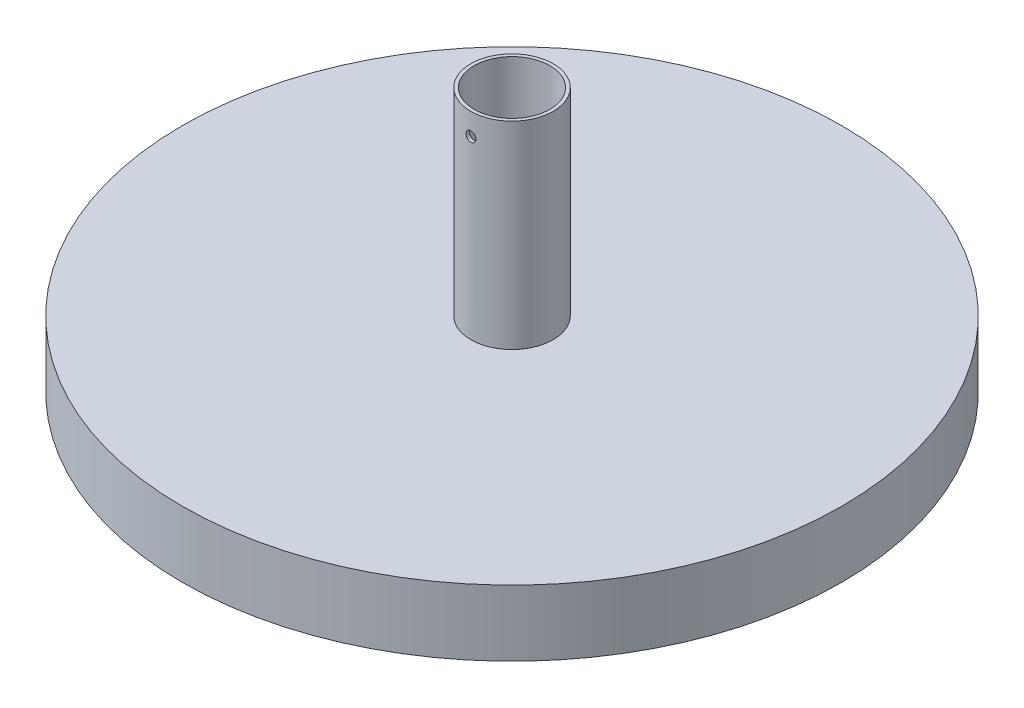
ISO-10303-21;
HEADER;
FILE_DESCRIPTION(('STEP AP214'),'2;1');
FILE_NAME('part.step','',(''),(''),'','','');
FILE_SCHEMA(('AUTOMOTIVE_DESIGN { 1 0 10303 214 1 1 1 1 }'));
ENDSEC;
DATA;
#1=APPLICATION_CONTEXT('core data for automotive mechanical design processes');
#2=APPLICATION_PROTOCOL_DEFINITION('international standard','automotive_design',2000,#1);
#3=PRODUCT_CONTEXT('',#1,'mechanical');
#4=PRODUCT('Part','Part','',(#3));
#5=PRODUCT_RELATED_PRODUCT_CATEGORY('part','',(#4));
#6=PRODUCT_DEFINITION_FORMATION('','',#4);
#7=PRODUCT_DEFINITION_CONTEXT('part definition',#1,'design');
#8=PRODUCT_DEFINITION('design','',#6,#7);
#9=PRODUCT_DEFINITION_SHAPE('','',#8);
#10=(LENGTH_UNIT() NAMED_UNIT(*) SI_UNIT(.MILLI.,.METRE.));
#11=(NAMED_UNIT(*) PLANE_ANGLE_UNIT() SI_UNIT($,.RADIAN.));
#12=(NAMED_UNIT(*) SI_UNIT($,.STERADIAN.) SOLID_ANGLE_UNIT());
#13=UNCERTAINTY_MEASURE_WITH_UNIT(LENGTH_MEASURE(1.E-05),#10,'distance_accuracy_value','');
#14=(GEOMETRIC_REPRESENTATION_CONTEXT(3) GLOBAL_UNCERTAINTY_ASSIGNED_CONTEXT((#13)) GLOBAL_UNIT_ASSIGNED_CONTEXT((#10,
#11,#12)) REPRESENTATION_CONTEXT('',''));
#15=CARTESIAN_POINT('',(0.,0.,0.));
#16=DIRECTION('',(0.,0.,1.));
#17=DIRECTION('',(1.,0.,0.));
#18=AXIS2_PLACEMENT_3D('',#15,#16,#17);
#19=CARTESIAN_POINT('',(0.,80.,0.));
#20=DIRECTION('',(0.,-1.,0.));
#21=DIRECTION('',(0.,0.,-1.));
#22=AXIS2_PLACEMENT_3D('',#19,#20,#21);
#23=CYLINDRICAL_SURFACE('',#22,12.5);
#24=CARTESIAN_POINT('',(0.,80.,0.));
#25=DIRECTION('',(0.,1.,0.));
#26=DIRECTION('',(0.,0.,1.));
#27=AXIS2_PLACEMENT_3D('',#24,#25,#26);
#28=CIRCLE('',#27,12.5);
#29=CARTESIAN_POINT('',(0.,80.,12.5));
#30=VERTEX_POINT('',#29);
#31=EDGE_CURVE('E55',#30,#30,#28,.T.);
#32=ORIENTED_EDGE('',*,*,#31,.F.);
#33=EDGE_LOOP('',(#32));
#34=FACE_BOUND('',#33,.T.);
#35=CARTESIAN_POINT('',(0.,20.,0.));
#36=DIRECTION('',(0.,1.,0.));
#37=DIRECTION('',(0.,0.,1.));
#38=AXIS2_PLACEMENT_3D('',#35,#36,#37);
#39=CIRCLE('',#38,12.5);
#40=CARTESIAN_POINT('',(0.,20.,12.5));
#41=VERTEX_POINT('',#40);
#42=EDGE_CURVE('E57',#41,#41,#39,.T.);
#43=ORIENTED_EDGE('',*,*,#42,.T.);
#44=EDGE_LOOP('',(#43));
#45=FACE_BOUND('',#44,.T.);
#46=CARTESIAN_POINT('',(-1.5,73.3831743689609,12.4096736459908));
#47=CARTESIAN_POINT('',(-1.49999641586388,73.4671039395561,12.4096748089167));
#48=CARTESIAN_POINT('',(-1.49293206748169,73.5510866290216,12.4105342894214));
#49=CARTESIAN_POINT('',(-1.46486159354819,73.7167166749767,12.4138782255217));
#50=CARTESIAN_POINT('',(-1.44384072619509,73.7983614668014,12.4163643992983));
#51=CARTESIAN_POINT('',(-1.38848417307918,73.9568935717178,12.4226761552619));
#52=CARTESIAN_POINT('',(-1.35415731394875,74.033783999529,12.426500849368));
#53=CARTESIAN_POINT('',(-1.27318168778972,74.1806979400113,12.4350576249844));
#54=CARTESIAN_POINT('',(-1.22653510106008,74.2507226647448,12.4397895458966));
#55=CARTESIAN_POINT('',(-1.1219857196502,74.382294254766,12.4496550027324));
#56=CARTESIAN_POINT('',(-1.06403198625324,74.4438005161352,12.4547902908254));
#57=CARTESIAN_POINT('',(-0.938622932174408,74.5562387280418,12.4648680792729));
#58=CARTESIAN_POINT('',(-0.87116714752708,74.6071701619318,12.4698105701984));
#59=CARTESIAN_POINT('',(-0.728414784233999,74.697157635429,12.4789637011531));
#60=CARTESIAN_POINT('',(-0.653094976924504,74.7361770768307,12.4831720690333));
#61=CARTESIAN_POINT('',(-0.496912883636399,74.8009985991532,12.4903635621621));
#62=CARTESIAN_POINT('',(-0.416050788042783,74.8268011338347,12.4933467294733));
#63=CARTESIAN_POINT('',(-0.251493928492555,74.8643354970126,12.4977393662263));
#64=CARTESIAN_POINT('',(-0.167814735521703,74.8761346956838,12.4991563682204));
#65=CARTESIAN_POINT('',(0.000347248334270155,74.8855361686161,12.5002827183051));
#66=CARTESIAN_POINT('',(0.0848300098341581,74.88313896004,12.4999921286017));
#67=CARTESIAN_POINT('',(0.251742833758755,74.8642698080352,12.4977421462633));
#68=CARTESIAN_POINT('',(0.334181218784098,74.8478703164747,12.4957913442169));
#69=CARTESIAN_POINT('',(0.49512718504558,74.8015752931029,12.490449821119));
#70=CARTESIAN_POINT('',(0.573634696521293,74.7716795218701,12.4870590745233));
#71=CARTESIAN_POINT('',(0.72471556162968,74.6991630045076,12.4792038952277));
#72=CARTESIAN_POINT('',(0.797273648637686,74.6565107509577,12.4747368094346));
#73=CARTESIAN_POINT('',(0.934229460099386,74.5597149194828,12.465229048358));
#74=CARTESIAN_POINT('',(0.998626839383438,74.5055708557531,12.4601883488298));
#75=CARTESIAN_POINT('',(1.11785860561524,74.3869221941906,12.4500603372648));
#76=CARTESIAN_POINT('',(1.17263019439189,74.3223544782741,12.4449729316271));
#77=CARTESIAN_POINT('',(1.27056795912578,74.1849086121211,12.4353563023037));
#78=CARTESIAN_POINT('',(1.31373410365262,74.1120304393786,12.4308270801297));
#79=CARTESIAN_POINT('',(1.38723839179324,73.9599781238872,12.4228396027608));
#80=CARTESIAN_POINT('',(1.4175717557882,73.8808016483319,12.4193817467283));
#81=CARTESIAN_POINT('',(1.46449505016188,73.7184281892103,12.4139364153306));
#82=CARTESIAN_POINT('',(1.48108558929275,73.6352313839012,12.4119488748366));
#83=CARTESIAN_POINT('',(1.49996964356083,73.4677328207725,12.4096810007818));
#84=CARTESIAN_POINT('',(1.50235142135386,73.3834411510203,12.4093901280317));
#85=CARTESIAN_POINT('',(1.49298299027802,73.2156599785394,12.4105206650573));
#86=CARTESIAN_POINT('',(1.48123305845624,73.1321704601172,12.411942041265));
#87=CARTESIAN_POINT('',(1.44400895971009,72.9686264771619,12.4163273137489));
#88=CARTESIAN_POINT('',(1.41857731249469,72.8885621955562,12.4192864301079));
#89=CARTESIAN_POINT('',(1.35475538396312,72.7338347274729,12.4264098926624));
#90=CARTESIAN_POINT('',(1.31636468129306,72.6591717167094,12.4305742780457));
#91=CARTESIAN_POINT('',(1.22749651360806,72.5169662214736,12.439664365665));
#92=CARTESIAN_POINT('',(1.17696103570738,72.4494602255202,12.4445936804928));
#93=CARTESIAN_POINT('',(1.06532008918354,72.323856812455,12.4546467770184));
#94=CARTESIAN_POINT('',(1.00421424221811,72.2657597322579,12.4597705656719));
#95=CARTESIAN_POINT('',(0.872782136333877,72.1603144953434,12.4696675472455));
#96=CARTESIAN_POINT('',(0.802409249708932,72.1130242457052,12.4744387628015));
#97=CARTESIAN_POINT('',(0.654668214705303,72.0309352642963,12.483063621558));
#98=CARTESIAN_POINT('',(0.577300197822221,71.9961362977737,12.4869172820019));
#99=CARTESIAN_POINT('',(0.417959622360004,71.940113866523,12.4932640215257));
#100=CARTESIAN_POINT('',(0.335999085323601,71.9188566090188,12.4957604851314));
#101=CARTESIAN_POINT('',(0.169640292495747,71.8904109971698,12.4991255682254));
#102=CARTESIAN_POINT('',(0.0852421377306375,71.8832220606143,12.4999942550783));
#103=CARTESIAN_POINT('',(-0.0830300031278225,71.8831274469047,12.5000056524324));
#104=CARTESIAN_POINT('',(-0.166903952329428,71.8901323506193,12.4991591682624));
#105=CARTESIAN_POINT('',(-0.332273612398109,71.9180375964121,12.4958567701035));
#106=CARTESIAN_POINT('',(-0.413769324044735,71.9389379339356,12.4934008566421));
#107=CARTESIAN_POINT('',(-0.5720597779918,71.9940133765267,12.4871544009745));
#108=CARTESIAN_POINT('',(-0.648855904373991,72.0281845511881,12.4833642539575));
#109=CARTESIAN_POINT('',(-0.795637705262649,72.1088224037531,12.474869622158));
#110=CARTESIAN_POINT('',(-0.865623324646845,72.1552891811623,12.4701651299761));
#111=CARTESIAN_POINT('',(-0.997254742124286,72.259531209964,12.4603319681132));
#112=CARTESIAN_POINT('',(-1.05884763393839,72.3173730466238,12.4552009088046));
#113=CARTESIAN_POINT('',(-1.17148865356204,72.4425858875371,12.4451123432295));
#114=CARTESIAN_POINT('',(-1.22253427406543,72.5099591512115,12.4401548784622));
#115=CARTESIAN_POINT('',(-1.31278537364372,72.6525958370461,12.4309559603764));
#116=CARTESIAN_POINT('',(-1.35194799100154,72.7278865330973,12.4267171228205));
#117=CARTESIAN_POINT('',(-1.41701902911871,72.8839832458362,12.419466118837));
#118=CARTESIAN_POINT('',(-1.44294198213014,72.9647831045597,12.4164526081981));
#119=CARTESIAN_POINT('',(-1.4745350503682,73.1022041385136,12.4127313618494));
#120=CARTESIAN_POINT('',(-1.48407082470974,73.1579557449408,12.4115903654975));
#121=CARTESIAN_POINT('',(-1.49680448454756,73.270188335028,12.4100611186528));
#122=CARTESIAN_POINT('',(-1.50000241299709,73.3266693137422,12.4096728630583));
#123=CARTESIAN_POINT('',(-1.5,73.3831743689609,12.4096736459908));
#124=B_SPLINE_CURVE_WITH_KNOTS('',3,(#46,#47,#48,#49,#50,#51,#52,#53,#54,#55,#56,#57,#58,#59,
#60,#61,#62,#63,#64,#65,#66,#67,#68,#69,#70,#71,#72,#73,#74,#75,#76,#77,#78,#79,#80,#81,#82,#83,
#84,#85,#86,#87,#88,#89,#90,#91,#92,#93,#94,#95,#96,#97,#98,#99,#100,#101,#102,#103,#104,#105,
#106,#107,#108,#109,#110,#111,#112,#113,#114,#115,#116,#117,#118,#119,#120,#121,#122,#123),
.UNSPECIFIED.,.T.,.F.,(4,2,2,2,2,2,2,2,2,2,2,2,2,2,2,2,2,2,2,2,2,2,2,2,2,2,2,2,2,2,2,2,2,2,2,2,
2,2,4),(0.,0.2515823066096,0.503430774819304,0.755112462522241,1.00674963836109,
1.25954776660375,1.51235824273609,1.76593780876768,2.01950866836446,2.27185458608051,
2.52419131111311,2.77523023079343,3.02627360403334,3.27794222677635,3.52962149067917,
3.78288622204421,4.03615163930558,4.28951130338292,4.5428597440408,4.79463277043146,
5.04640086098249,5.29739099483104,5.54838929022027,5.80061125155307,6.05284224246466,
6.30639464647637,6.55994228515917,6.81285470170486,7.06575665136927,7.31707030939075,
7.56838388503436,7.81962308616497,8.07086432058376,8.32362252061904,8.5764407375911,
8.83016031080821,9.08360079205961,9.25297814464871,9.42235434931909),.UNSPECIFIED.);
#125=CARTESIAN_POINT('',(-1.5,73.3831743689609,12.4096736459908));
#126=VERTEX_POINT('',#125);
#127=EDGE_CURVE('E65',#126,#126,#124,.T.);
#128=ORIENTED_EDGE('',*,*,#127,.T.);
#129=EDGE_LOOP('',(#128));
#130=FACE_BOUND('',#129,.T.);
#131=ADVANCED_FACE('F34',(#34,#45,#130),#23,.T.);
#132=CARTESIAN_POINT('',(0.,80.,0.));
#133=DIRECTION('',(0.,-1.,0.));
#134=DIRECTION('',(0.,0.,-1.));
#135=AXIS2_PLACEMENT_3D('',#132,#133,#134);
#136=CYLINDRICAL_SURFACE('',#135,11.5);
#137=CARTESIAN_POINT('',(0.,20.,0.));
#138=DIRECTION('',(0.,1.,0.));
#139=DIRECTION('',(0.,0.,1.));
#140=AXIS2_PLACEMENT_3D('',#137,#138,#139);
#141=CIRCLE('',#140,11.5);
#142=CARTESIAN_POINT('',(0.,20.,11.5));
#143=VERTEX_POINT('',#142);
#144=EDGE_CURVE('E10',#143,#143,#141,.F.);
#145=ORIENTED_EDGE('',*,*,#144,.T.);
#146=EDGE_LOOP('',(#145));
#147=FACE_BOUND('',#146,.T.);
#148=CARTESIAN_POINT('',(0.,80.,0.));
#149=DIRECTION('',(0.,1.,0.));
#150=DIRECTION('',(0.,0.,1.));
#151=AXIS2_PLACEMENT_3D('',#148,#149,#150);
#152=CIRCLE('',#151,11.5);
#153=CARTESIAN_POINT('',(0.,80.,11.5));
#154=VERTEX_POINT('',#153);
#155=EDGE_CURVE('E60',#154,#154,#152,.T.);
#156=ORIENTED_EDGE('',*,*,#155,.T.);
#157=EDGE_LOOP('',(#156));
#158=FACE_BOUND('',#157,.T.);
#159=CARTESIAN_POINT('',(-1.5,73.3831743689609,11.4017542509914));
#160=CARTESIAN_POINT('',(-1.4999964530145,73.2993041150144,11.4017555010926));
#161=CARTESIAN_POINT('',(-1.49294203416221,73.2153821942801,11.4026896606142));
#162=CARTESIAN_POINT('',(-1.46491333453698,73.049876092776,11.4063237260242));
#163=CARTESIAN_POINT('',(-1.44392470388228,72.9682944125057,11.4090254521656));
#164=CARTESIAN_POINT('',(-1.3886587589991,72.8098888875869,11.4158835494573));
#165=CARTESIAN_POINT('',(-1.3543907018073,72.7330617717207,11.4200389070908));
#166=CARTESIAN_POINT('',(-1.27355889313979,72.5862621128927,11.4293348464697));
#167=CARTESIAN_POINT('',(-1.22699716043964,72.5162884470926,11.4344752664174));
#168=CARTESIAN_POINT('',(-1.12259656958886,72.3847427559446,11.445197137233));
#169=CARTESIAN_POINT('',(-1.06469780379541,72.3232184535593,11.450780832969));
#170=CARTESIAN_POINT('',(-0.939395748791597,72.2107304472991,11.4617399588797));
#171=CARTESIAN_POINT('',(-0.871991977267106,72.1597672796539,11.4671153784682));
#172=CARTESIAN_POINT('',(-0.729292001348489,72.0696759204419,11.4770753814867));
#173=CARTESIAN_POINT('',(-0.653968201092629,72.0305910886122,11.4816570418954));
#174=CARTESIAN_POINT('',(-0.497756037054314,71.9656437023167,11.4894885821545));
#175=CARTESIAN_POINT('',(-0.416867897538947,71.9397806153109,11.4927385156426));
#176=CARTESIAN_POINT('',(-0.25231209376423,71.90215392965,11.4975246059022));
#177=CARTESIAN_POINT('',(-0.168662889559628,71.8903108463172,11.4990704204953));
#178=CARTESIAN_POINT('',(-0.000551051593627484,71.8808139196504,11.5003071067839));
#179=CARTESIAN_POINT('',(0.0839115473355959,71.8831594713873,11.4999980575609));
#180=CARTESIAN_POINT('',(0.250711499958829,71.9019097307406,11.4975676318304));
#181=CARTESIAN_POINT('',(0.333058646852879,71.918228949083,11.495457275758));
#182=CARTESIAN_POINT('',(0.493835455554842,71.9643295496878,11.4896737037343));
#183=CARTESIAN_POINT('',(0.572265037316039,71.9941112069001,11.4860004558634));
#184=CARTESIAN_POINT('',(0.723243851165387,72.0663815147349,11.4774848372199));
#185=CARTESIAN_POINT('',(0.795775273641199,72.1089069570563,11.4726390893116));
#186=CARTESIAN_POINT('',(0.932704606534633,72.2054309114152,11.4623201935655));
#187=CARTESIAN_POINT('',(0.997102110698515,72.25942999615,11.4568470144162));
#188=CARTESIAN_POINT('',(1.11643819513604,72.3778467003042,11.4458372756446));
#189=CARTESIAN_POINT('',(1.17130282662102,72.4423388535874,11.4403005474487));
#190=CARTESIAN_POINT('',(1.2694404810369,72.5796555321102,11.4298278324284));
#191=CARTESIAN_POINT('',(1.31271346156177,72.6524800878311,11.4248918478017));
#192=CARTESIAN_POINT('',(1.38644483776161,72.8044624959882,11.4161795912173));
#193=CARTESIAN_POINT('',(1.41689697165318,72.8836234207373,11.4124038861902));
#194=CARTESIAN_POINT('',(1.46405488015557,73.0459957147137,11.4064505206358));
#195=CARTESIAN_POINT('',(1.48076137834162,73.1292068704912,11.4042727759921));
#196=CARTESIAN_POINT('',(1.49985514370483,73.2966634827124,11.4017774109739));
#197=CARTESIAN_POINT('',(1.50234663257981,73.3808968613547,11.4014462521966));
#198=CARTESIAN_POINT('',(1.49321496203163,73.5485798413725,11.4026457215703));
#199=CARTESIAN_POINT('',(1.48159213091645,73.6320294609334,11.4041763064158));
#200=CARTESIAN_POINT('',(1.44464963434862,73.7954616390173,11.4089144348313));
#201=CARTESIAN_POINT('',(1.41938072914779,73.8754558672874,11.4121157621508));
#202=CARTESIAN_POINT('',(1.35591573806609,74.0300721888816,11.4198296111094));
#203=CARTESIAN_POINT('',(1.31771916001083,74.104694077542,11.4243421826685));
#204=CARTESIAN_POINT('',(1.22922802110627,74.2469181358579,11.4342023912125));
#205=CARTESIAN_POINT('',(1.17886529183312,74.3144775641928,11.4395546717525));
#206=CARTESIAN_POINT('',(1.06756750174709,74.4402221749295,11.4504767766229));
#207=CARTESIAN_POINT('',(1.00663199235395,74.4984069593834,11.4560466101759));
#208=CARTESIAN_POINT('',(0.875462338341604,74.6041183978418,11.4668179794224));
#209=CARTESIAN_POINT('',(0.805172669271255,74.6515764479738,11.4720170065382));
#210=CARTESIAN_POINT('',(0.657558967858992,74.7340119043704,11.4814231748458));
#211=CARTESIAN_POINT('',(0.580235088015162,74.7689895811224,11.4856303375335));
#212=CARTESIAN_POINT('',(0.420973071168357,74.8253588534411,11.4925676402684));
#213=CARTESIAN_POINT('',(0.339049006517437,74.846789662088,11.4953020399787));
#214=CARTESIAN_POINT('',(0.172727196515991,74.8755842986769,11.4990034533124));
#215=CARTESIAN_POINT('',(0.0883295733447125,74.8829488202259,11.4999705540811));
#216=CARTESIAN_POINT('',(-0.0798746769516697,74.883388067676,11.5000279000696));
#217=CARTESIAN_POINT('',(-0.163681043071275,74.8765684091103,11.4991320170928));
#218=CARTESIAN_POINT('',(-0.328945491538632,74.8490571150211,11.4955917059201));
#219=CARTESIAN_POINT('',(-0.410403576567152,74.8283654953342,11.4929472797203));
#220=CARTESIAN_POINT('',(-0.568642219855311,74.7737317027471,11.4862056490748));
#221=CARTESIAN_POINT('',(-0.645424712431703,74.7397950530333,11.4821090502512));
#222=CARTESIAN_POINT('',(-0.79222178732859,74.6596455066347,11.4729159452671));
#223=CARTESIAN_POINT('',(-0.862236260369656,74.6134324117742,11.4678194229654));
#224=CARTESIAN_POINT('',(-0.994048728546025,74.5096527127709,11.4571496362498));
#225=CARTESIAN_POINT('',(-1.05578467493494,74.4520076166137,11.4515732358814));
#226=CARTESIAN_POINT('',(-1.16874758745895,74.3271640677122,11.4405969587125));
#227=CARTESIAN_POINT('',(-1.21997206693609,74.259963360784,11.4351971239349));
#228=CARTESIAN_POINT('',(-1.31064441090517,74.1175900154776,11.425161148306));
#229=CARTESIAN_POINT('',(-1.3500418637493,74.0423850523344,11.4205283132887));
#230=CARTESIAN_POINT('',(-1.41559127347486,73.8864065336068,11.4125895944072));
#231=CARTESIAN_POINT('',(-1.44175750369104,73.8056390859843,11.4092822814234));
#232=CARTESIAN_POINT('',(-1.47390259785781,73.6675825703195,11.4051643222105));
#233=CARTESIAN_POINT('',(-1.48367487173576,73.6111609553857,11.4038919959272));
#234=CARTESIAN_POINT('',(-1.49672475464482,73.4975590241319,11.4021865375875));
#235=CARTESIAN_POINT('',(-1.50000241924847,73.4403787143081,11.4017533983503));
#236=CARTESIAN_POINT('',(-1.5,73.3831743689609,11.4017542509914));
#237=B_SPLINE_CURVE_WITH_KNOTS('',3,(#159,#160,#161,#162,#163,#164,#165,#166,#167,#168,#169,
#170,#171,#172,#173,#174,#175,#176,#177,#178,#179,#180,#181,#182,#183,#184,#185,#186,#187,#188,
#189,#190,#191,#192,#193,#194,#195,#196,#197,#198,#199,#200,#201,#202,#203,#204,#205,#206,#207,
#208,#209,#210,#211,#212,#213,#214,#215,#216,#217,#218,#219,#220,#221,#222,#223,#224,#225,#226,
#227,#228,#229,#230,#231,#232,#233,#234,#235,#236),.UNSPECIFIED.,.T.,.F.,(4,2,2,2,2,2,2,2,2,2,2,
2,2,2,2,2,2,2,2,2,2,2,2,2,2,2,2,2,2,2,2,2,2,2,2,2,2,2,4),(0.,0.251401763409767,
0.503062830563605,0.754548780434035,1.00599345881712,1.25880454908431,1.51162847240694,
1.76536449581032,2.01909029853276,2.27137063822619,2.52364022208435,2.77437738752205,
3.0251196741212,3.27659295200133,3.5280787849124,3.7814359080699,4.03479395807763,
4.28827560662901,4.54174391096105,4.79335142269096,5.04495308198345,5.29562522352573,
5.54630690957675,5.79842717499934,6.05055813995757,6.30425867142355,6.55795370410216,
6.8109109813241,7.0638557849315,7.31492390374274,7.56599173592654,7.81695498432957,
8.06792228421935,8.32067641903949,8.57349027819167,8.82736691371985,9.08096908946925,
9.25244104378407,9.42391153085534),.UNSPECIFIED.);
#238=CARTESIAN_POINT('',(-1.5,73.3831743689609,11.4017542509914));
#239=VERTEX_POINT('',#238);
#240=EDGE_CURVE('E38',#239,#239,#237,.T.);
#241=ORIENTED_EDGE('',*,*,#240,.T.);
#242=EDGE_LOOP('',(#241));
#243=FACE_BOUND('',#242,.T.);
#244=ADVANCED_FACE('F74',(#147,#158,#243),#136,.F.);
#245=CARTESIAN_POINT('',(0.,20.,0.));
#246=DIRECTION('',(0.,-1.,0.));
#247=DIRECTION('',(0.,0.,-1.));
#248=AXIS2_PLACEMENT_3D('',#245,#246,#247);
#249=CYLINDRICAL_SURFACE('',#248,100.);
#250=CARTESIAN_POINT('',(0.,20.,0.));
#251=DIRECTION('',(0.,1.,0.));
#252=DIRECTION('',(0.,0.,1.));
#253=AXIS2_PLACEMENT_3D('',#250,#251,#252);
#254=CIRCLE('',#253,100.);
#255=CARTESIAN_POINT('',(0.,20.,100.));
#256=VERTEX_POINT('',#255);
#257=EDGE_CURVE('E47',#256,#256,#254,.T.);
#258=ORIENTED_EDGE('',*,*,#257,.F.);
#259=EDGE_LOOP('',(#258));
#260=FACE_BOUND('',#259,.T.);
#261=CARTESIAN_POINT('',(0.,0.,0.));
#262=DIRECTION('',(0.,1.,0.));
#263=DIRECTION('',(0.,0.,1.));
#264=AXIS2_PLACEMENT_3D('',#261,#262,#263);
#265=CIRCLE('',#264,100.);
#266=CARTESIAN_POINT('',(0.,0.,100.));
#267=VERTEX_POINT('',#266);
#268=EDGE_CURVE('E51',#267,#267,#265,.T.);
#269=ORIENTED_EDGE('',*,*,#268,.T.);
#270=EDGE_LOOP('',(#269));
#271=FACE_BOUND('',#270,.T.);
#272=ADVANCED_FACE('F36',(#260,#271),#249,.T.);
#273=CARTESIAN_POINT('',(0.,20.,0.));
#274=DIRECTION('',(0.,1.,0.));
#275=DIRECTION('',(0.,0.,1.));
#276=AXIS2_PLACEMENT_3D('',#273,#274,#275);
#277=PLANE('',#276);
#278=ORIENTED_EDGE('',*,*,#42,.F.);
#279=EDGE_LOOP('',(#278));
#280=FACE_BOUND('',#279,.T.);
#281=ORIENTED_EDGE('',*,*,#257,.T.);
#282=EDGE_LOOP('',(#281));
#283=FACE_BOUND('',#282,.T.);
#284=ADVANCED_FACE('F87',(#280,#283),#277,.T.);
#285=CARTESIAN_POINT('',(0.,0.,0.));
#286=DIRECTION('',(0.,1.,0.));
#287=DIRECTION('',(0.,0.,1.));
#288=AXIS2_PLACEMENT_3D('',#285,#286,#287);
#289=PLANE('',#288);
#290=ORIENTED_EDGE('',*,*,#268,.F.);
#291=EDGE_LOOP('',(#290));
#292=FACE_BOUND('',#291,.T.);
#293=ADVANCED_FACE('F82',(#292),#289,.F.);
#294=CARTESIAN_POINT('',(0.,80.,0.));
#295=DIRECTION('',(0.,1.,0.));
#296=DIRECTION('',(0.,0.,1.));
#297=AXIS2_PLACEMENT_3D('',#294,#295,#296);
#298=PLANE('',#297);
#299=ORIENTED_EDGE('',*,*,#31,.T.);
#300=EDGE_LOOP('',(#299));
#301=FACE_BOUND('',#300,.T.);
#302=ORIENTED_EDGE('',*,*,#155,.F.);
#303=EDGE_LOOP('',(#302));
#304=FACE_BOUND('',#303,.T.);
#305=ADVANCED_FACE('F78',(#301,#304),#298,.T.);
#306=ORIENTED_EDGE('',*,*,#144,.F.);
#307=EDGE_LOOP('',(#306));
#308=FACE_BOUND('',#307,.T.);
#309=ADVANCED_FACE('F81',(#308),#277,.T.);
#310=CARTESIAN_POINT('',(0.,73.3831743689609,100.001));
#311=DIRECTION('',(0.,0.,-1.));
#312=DIRECTION('',(-1.,0.,0.));
#313=AXIS2_PLACEMENT_3D('',#310,#311,#312);
#314=CYLINDRICAL_SURFACE('',#313,1.5);
#315=ORIENTED_EDGE('',*,*,#240,.F.);
#316=EDGE_LOOP('',(#315));
#317=FACE_BOUND('',#316,.T.);
#318=ORIENTED_EDGE('',*,*,#127,.F.);
#319=EDGE_LOOP('',(#318));
#320=FACE_BOUND('',#319,.T.);
#321=ADVANCED_FACE('F71',(#317,#320),#314,.F.);
#322=CLOSED_SHELL('',(#131,#244,#272,#284,#293,#305,#309,#321));
#323=MANIFOLD_SOLID_BREP('B2',#322);
#324=ADVANCED_BREP_SHAPE_REPRESENTATION('',(#18,#323),#14);
#325=SHAPE_DEFINITION_REPRESENTATION(#9,#324);
ENDSEC;
END-ISO-10303-21;
